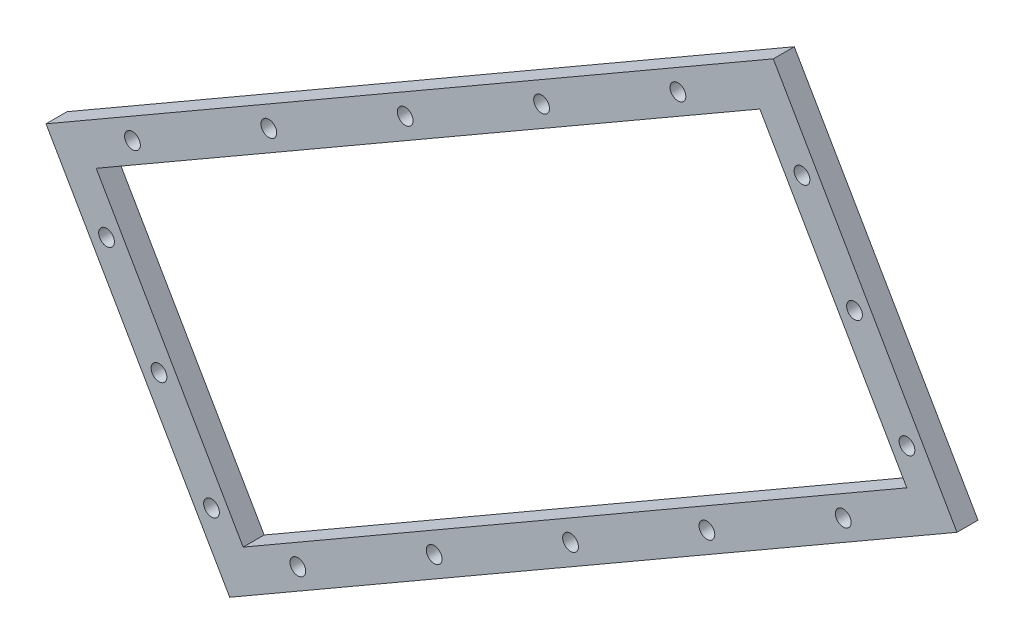
ISO-10303-21;
HEADER;
FILE_DESCRIPTION(('STEP AP214'),'2;1');
FILE_NAME('part.step','',(''),(''),'','','');
FILE_SCHEMA(('AUTOMOTIVE_DESIGN { 1 0 10303 214 1 1 1 1 }'));
ENDSEC;
DATA;
#1=APPLICATION_CONTEXT('core data for automotive mechanical design processes');
#2=APPLICATION_PROTOCOL_DEFINITION('international standard','automotive_design',2000,#1);
#3=PRODUCT_CONTEXT('',#1,'mechanical');
#4=PRODUCT('Part','Part','',(#3));
#5=PRODUCT_RELATED_PRODUCT_CATEGORY('part','',(#4));
#6=PRODUCT_DEFINITION_FORMATION('','',#4);
#7=PRODUCT_DEFINITION_CONTEXT('part definition',#1,'design');
#8=PRODUCT_DEFINITION('design','',#6,#7);
#9=PRODUCT_DEFINITION_SHAPE('','',#8);
#10=(LENGTH_UNIT() NAMED_UNIT(*) SI_UNIT(.MILLI.,.METRE.));
#11=(NAMED_UNIT(*) PLANE_ANGLE_UNIT() SI_UNIT($,.RADIAN.));
#12=(NAMED_UNIT(*) SI_UNIT($,.STERADIAN.) SOLID_ANGLE_UNIT());
#13=UNCERTAINTY_MEASURE_WITH_UNIT(LENGTH_MEASURE(1.E-05),#10,'distance_accuracy_value','');
#14=(GEOMETRIC_REPRESENTATION_CONTEXT(3) GLOBAL_UNCERTAINTY_ASSIGNED_CONTEXT((#13)) GLOBAL_UNIT_ASSIGNED_CONTEXT((#10,
#11,#12)) REPRESENTATION_CONTEXT('',''));
#15=CARTESIAN_POINT('',(0.,0.,0.));
#16=DIRECTION('',(0.,0.,1.));
#17=DIRECTION('',(1.,0.,0.));
#18=AXIS2_PLACEMENT_3D('',#15,#16,#17);
#19=CARTESIAN_POINT('',(-80.3616729028382,-5.98231463967729,236.380771430245));
#20=DIRECTION('',(0.866025403784439,0.5,0.));
#21=DIRECTION('',(-0.5,0.866025403784439,0.));
#22=AXIS2_PLACEMENT_3D('',#19,#20,#21);
#23=PLANE('',#22);
#24=DIRECTION('',(0.5,-0.866025403784439,0.));
#25=VECTOR('',#24,1.);
#26=CARTESIAN_POINT('',(-80.3616729028382,-5.98231463967729,7.00000000000001));
#27=LINE('',#26,#25);
#28=CARTESIAN_POINT('',(-80.3616729028382,-5.9823146396773,7.00000000000001));
#29=VERTEX_POINT('',#28);
#30=CARTESIAN_POINT('',(-45.3616729028381,-66.604092904588,7.00000000000001));
#31=VERTEX_POINT('',#30);
#32=EDGE_CURVE('E3574',#29,#31,#27,.T.);
#33=ORIENTED_EDGE('',*,*,#32,.F.);
#34=DIRECTION('',(0.,0.,1.));
#35=VECTOR('',#34,1.);
#36=CARTESIAN_POINT('',(-80.3616729028382,-5.9823146396773,-66.));
#37=LINE('',#36,#35);
#38=CARTESIAN_POINT('',(-80.3616729028382,-5.9823146396773,3.));
#39=VERTEX_POINT('',#38);
#40=EDGE_CURVE('E3701',#39,#29,#37,.T.);
#41=ORIENTED_EDGE('',*,*,#40,.F.);
#42=DIRECTION('',(0.5,-0.866025403784439,0.));
#43=VECTOR('',#42,1.);
#44=CARTESIAN_POINT('',(-80.3616729028382,-5.98231463967729,3.));
#45=LINE('',#44,#43);
#46=CARTESIAN_POINT('',(-45.3616729028381,-66.604092904588,3.));
#47=VERTEX_POINT('',#46);
#48=EDGE_CURVE('E3735',#39,#47,#45,.T.);
#49=ORIENTED_EDGE('',*,*,#48,.T.);
#50=DIRECTION('',(0.,0.,1.));
#51=VECTOR('',#50,1.);
#52=CARTESIAN_POINT('',(-45.3616729028381,-66.604092904588,-66.));
#53=LINE('',#52,#51);
#54=EDGE_CURVE('E3692',#47,#31,#53,.T.);
#55=ORIENTED_EDGE('',*,*,#54,.T.);
#56=EDGE_LOOP('',(#33,#41,#49,#55));
#57=FACE_BOUND('',#56,.T.);
#58=ADVANCED_FACE('F3556',(#57),#23,.F.);
#59=CARTESIAN_POINT('',(58.202391702672,74.0176853603227,236.380771430245));
#60=DIRECTION('',(-0.866025403784439,-0.5,0.));
#61=DIRECTION('',(0.5,-0.866025403784439,0.));
#62=AXIS2_PLACEMENT_3D('',#59,#60,#61);
#63=PLANE('',#62);
#64=DIRECTION('',(-0.5,0.866025403784439,0.));
#65=VECTOR('',#64,1.);
#66=CARTESIAN_POINT('',(58.202391702672,74.0176853603227,7.00000000000001));
#67=LINE('',#66,#65);
#68=CARTESIAN_POINT('',(93.202391702672,13.395907095412,7.00000000000001));
#69=VERTEX_POINT('',#68);
#70=CARTESIAN_POINT('',(58.202391702672,74.0176853603227,7.00000000000001));
#71=VERTEX_POINT('',#70);
#72=EDGE_CURVE('E3780',#69,#71,#67,.T.);
#73=ORIENTED_EDGE('',*,*,#72,.F.);
#74=DIRECTION('',(0.,0.,-1.));
#75=VECTOR('',#74,1.);
#76=CARTESIAN_POINT('',(93.202391702672,13.395907095412,236.380771430245));
#77=LINE('',#76,#75);
#78=CARTESIAN_POINT('',(93.202391702672,13.3959070954119,3.));
#79=VERTEX_POINT('',#78);
#80=EDGE_CURVE('E3746',#69,#79,#77,.T.);
#81=ORIENTED_EDGE('',*,*,#80,.T.);
#82=DIRECTION('',(-0.5,0.866025403784439,0.));
#83=VECTOR('',#82,1.);
#84=CARTESIAN_POINT('',(58.202391702672,74.0176853603227,3.));
#85=LINE('',#84,#83);
#86=CARTESIAN_POINT('',(58.202391702672,74.0176853603227,3.));
#87=VERTEX_POINT('',#86);
#88=EDGE_CURVE('E3742',#79,#87,#85,.T.);
#89=ORIENTED_EDGE('',*,*,#88,.T.);
#90=DIRECTION('',(0.,0.,-1.));
#91=VECTOR('',#90,1.);
#92=CARTESIAN_POINT('',(58.202391702672,74.0176853603227,236.380771430245));
#93=LINE('',#92,#91);
#94=EDGE_CURVE('E3741',#71,#87,#93,.T.);
#95=ORIENTED_EDGE('',*,*,#94,.F.);
#96=EDGE_LOOP('',(#73,#81,#89,#95));
#97=FACE_BOUND('',#96,.T.);
#98=ADVANCED_FACE('F3798',(#97),#63,.F.);
#99=CARTESIAN_POINT('',(-80.3616729028382,-5.98231463967729,236.380771430245));
#100=DIRECTION('',(0.5,-0.866025403784438,0.));
#101=DIRECTION('',(0.866025403784439,0.5,0.));
#102=AXIS2_PLACEMENT_3D('',#99,#100,#101);
#103=PLANE('',#102);
#104=DIRECTION('',(-0.866025403784439,-0.5,0.));
#105=VECTOR('',#104,1.);
#106=CARTESIAN_POINT('',(-80.3616729028382,-5.98231463967729,7.00000000000001));
#107=LINE('',#106,#105);
#108=EDGE_CURVE('E3708',#71,#29,#107,.T.);
#109=ORIENTED_EDGE('',*,*,#108,.F.);
#110=ORIENTED_EDGE('',*,*,#94,.T.);
#111=DIRECTION('',(-0.866025403784438,-0.5,0.));
#112=VECTOR('',#111,1.);
#113=CARTESIAN_POINT('',(-80.3616729028382,-5.98231463967729,3.));
#114=LINE('',#113,#112);
#115=EDGE_CURVE('E3738',#87,#39,#114,.T.);
#116=ORIENTED_EDGE('',*,*,#115,.T.);
#117=ORIENTED_EDGE('',*,*,#40,.T.);
#118=EDGE_LOOP('',(#109,#110,#116,#117));
#119=FACE_BOUND('',#118,.T.);
#120=ADVANCED_FACE('F3789',(#119),#103,.F.);
#121=CARTESIAN_POINT('',(-45.3616729028382,-66.6040929045879,236.380771430245));
#122=DIRECTION('',(-0.499999999999999,0.866025403784439,0.));
#123=DIRECTION('',(-0.866025403784439,-0.499999999999999,0.));
#124=AXIS2_PLACEMENT_3D('',#121,#122,#123);
#125=PLANE('',#124);
#126=DIRECTION('',(0.866025403784439,0.499999999999999,0.));
#127=VECTOR('',#126,1.);
#128=CARTESIAN_POINT('',(-45.3616729028382,-66.6040929045879,7.00000000000001));
#129=LINE('',#128,#127);
#130=EDGE_CURVE('E3775',#31,#69,#129,.T.);
#131=ORIENTED_EDGE('',*,*,#130,.F.);
#132=ORIENTED_EDGE('',*,*,#54,.F.);
#133=DIRECTION('',(0.866025403784439,0.499999999999999,0.));
#134=VECTOR('',#133,1.);
#135=CARTESIAN_POINT('',(-45.3616729028382,-66.6040929045879,3.));
#136=LINE('',#135,#134);
#137=EDGE_CURVE('E3731',#47,#79,#136,.T.);
#138=ORIENTED_EDGE('',*,*,#137,.T.);
#139=ORIENTED_EDGE('',*,*,#80,.F.);
#140=EDGE_LOOP('',(#131,#132,#138,#139));
#141=FACE_BOUND('',#140,.T.);
#142=ADVANCED_FACE('F3795',(#141),#125,.F.);
#143=CARTESIAN_POINT('',(-70.7994950763471,-8.54449246616836,236.380771430245));
#144=DIRECTION('',(0.5,-0.866025403784439,0.));
#145=DIRECTION('',(0.866025403784439,0.5,0.));
#146=AXIS2_PLACEMENT_3D('',#143,#144,#145);
#147=PLANE('',#146);
#148=DIRECTION('',(0.,0.,-1.));
#149=VECTOR('',#148,1.);
#150=CARTESIAN_POINT('',(55.640213876181,64.4555075338316,236.380771430245));
#151=LINE('',#150,#149);
#152=CARTESIAN_POINT('',(55.640213876181,64.4555075338316,7.00000000000001));
#153=VERTEX_POINT('',#152);
#154=CARTESIAN_POINT('',(55.640213876181,64.4555075338316,3.));
#155=VERTEX_POINT('',#154);
#156=EDGE_CURVE('E3566',#153,#155,#151,.T.);
#157=ORIENTED_EDGE('',*,*,#156,.F.);
#158=DIRECTION('',(-0.866025403784439,-0.5,0.));
#159=VECTOR('',#158,1.);
#160=CARTESIAN_POINT('',(-70.7994950763471,-8.54449246616836,7.00000000000001));
#161=LINE('',#160,#159);
#162=CARTESIAN_POINT('',(-70.7994950763471,-8.54449246616836,7.00000000000001));
#163=VERTEX_POINT('',#162);
#164=EDGE_CURVE('E3582',#153,#163,#161,.T.);
#165=ORIENTED_EDGE('',*,*,#164,.T.);
#166=DIRECTION('',(0.,0.,-1.));
#167=VECTOR('',#166,1.);
#168=CARTESIAN_POINT('',(-70.7994950763471,-8.54449246616836,236.380771430245));
#169=LINE('',#168,#167);
#170=CARTESIAN_POINT('',(-70.7994950763471,-8.54449246616836,3.));
#171=VERTEX_POINT('',#170);
#172=EDGE_CURVE('E3651',#163,#171,#169,.T.);
#173=ORIENTED_EDGE('',*,*,#172,.T.);
#174=DIRECTION('',(-0.866025403784438,-0.5,0.));
#175=VECTOR('',#174,1.);
#176=CARTESIAN_POINT('',(-70.7994950763471,-8.54449246616836,3.));
#177=LINE('',#176,#175);
#178=EDGE_CURVE('E3687',#155,#171,#177,.T.);
#179=ORIENTED_EDGE('',*,*,#178,.F.);
#180=EDGE_LOOP('',(#157,#165,#173,#179));
#181=FACE_BOUND('',#180,.T.);
#182=ADVANCED_FACE('F3558',(#181),#147,.T.);
#183=CARTESIAN_POINT('',(-70.7994950763471,-8.54449246616836,236.380771430245));
#184=DIRECTION('',(0.866025403784439,0.5,0.));
#185=DIRECTION('',(-0.5,0.866025403784439,0.));
#186=AXIS2_PLACEMENT_3D('',#183,#184,#185);
#187=PLANE('',#186);
#188=ORIENTED_EDGE('',*,*,#172,.F.);
#189=DIRECTION('',(0.5,-0.866025403784439,0.));
#190=VECTOR('',#189,1.);
#191=CARTESIAN_POINT('',(-70.7994950763471,-8.54449246616836,7.00000000000001));
#192=LINE('',#191,#190);
#193=CARTESIAN_POINT('',(-42.7994950763471,-57.0419150780968,7.00000000000001));
#194=VERTEX_POINT('',#193);
#195=EDGE_CURVE('E3640',#163,#194,#192,.T.);
#196=ORIENTED_EDGE('',*,*,#195,.T.);
#197=DIRECTION('',(0.,0.,-1.));
#198=VECTOR('',#197,1.);
#199=CARTESIAN_POINT('',(-42.7994950763471,-57.0419150780968,236.380771430245));
#200=LINE('',#199,#198);
#201=CARTESIAN_POINT('',(-42.7994950763471,-57.0419150780968,3.));
#202=VERTEX_POINT('',#201);
#203=EDGE_CURVE('E3638',#194,#202,#200,.T.);
#204=ORIENTED_EDGE('',*,*,#203,.T.);
#205=DIRECTION('',(0.5,-0.866025403784439,0.));
#206=VECTOR('',#205,1.);
#207=CARTESIAN_POINT('',(-70.7994950763471,-8.54449246616836,3.));
#208=LINE('',#207,#206);
#209=EDGE_CURVE('E3752',#171,#202,#208,.T.);
#210=ORIENTED_EDGE('',*,*,#209,.F.);
#211=EDGE_LOOP('',(#188,#196,#204,#210));
#212=FACE_BOUND('',#211,.T.);
#213=ADVANCED_FACE('F3771',(#212),#187,.T.);
#214=CARTESIAN_POINT('',(-42.7994950763471,-57.0419150780968,236.380771430245));
#215=DIRECTION('',(-0.5,0.866025403784438,0.));
#216=DIRECTION('',(-0.866025403784439,-0.5,0.));
#217=AXIS2_PLACEMENT_3D('',#214,#215,#216);
#218=PLANE('',#217);
#219=ORIENTED_EDGE('',*,*,#203,.F.);
#220=DIRECTION('',(0.866025403784439,0.5,0.));
#221=VECTOR('',#220,1.);
#222=CARTESIAN_POINT('',(-42.7994950763471,-57.0419150780968,7.00000000000001));
#223=LINE('',#222,#221);
#224=CARTESIAN_POINT('',(83.6402138761809,15.9580849219032,7.00000000000001));
#225=VERTEX_POINT('',#224);
#226=EDGE_CURVE('E3624',#194,#225,#223,.T.);
#227=ORIENTED_EDGE('',*,*,#226,.T.);
#228=DIRECTION('',(0.,0.,-1.));
#229=VECTOR('',#228,1.);
#230=CARTESIAN_POINT('',(83.6402138761809,15.9580849219032,236.380771430245));
#231=LINE('',#230,#229);
#232=CARTESIAN_POINT('',(83.6402138761809,15.9580849219032,3.));
#233=VERTEX_POINT('',#232);
#234=EDGE_CURVE('E3636',#225,#233,#231,.T.);
#235=ORIENTED_EDGE('',*,*,#234,.T.);
#236=DIRECTION('',(0.866025403784438,0.5,0.));
#237=VECTOR('',#236,1.);
#238=CARTESIAN_POINT('',(-42.7994950763471,-57.0419150780968,3.));
#239=LINE('',#238,#237);
#240=EDGE_CURVE('E3749',#202,#233,#239,.T.);
#241=ORIENTED_EDGE('',*,*,#240,.F.);
#242=EDGE_LOOP('',(#219,#227,#235,#241));
#243=FACE_BOUND('',#242,.T.);
#244=ADVANCED_FACE('F3634',(#243),#218,.T.);
#245=CARTESIAN_POINT('',(55.640213876181,64.4555075338316,236.380771430245));
#246=DIRECTION('',(-0.866025403784439,-0.5,0.));
#247=DIRECTION('',(0.5,-0.866025403784439,0.));
#248=AXIS2_PLACEMENT_3D('',#245,#246,#247);
#249=PLANE('',#248);
#250=ORIENTED_EDGE('',*,*,#234,.F.);
#251=DIRECTION('',(-0.5,0.866025403784439,0.));
#252=VECTOR('',#251,1.);
#253=CARTESIAN_POINT('',(55.640213876181,64.4555075338316,7.00000000000001));
#254=LINE('',#253,#252);
#255=EDGE_CURVE('E3621',#225,#153,#254,.T.);
#256=ORIENTED_EDGE('',*,*,#255,.T.);
#257=ORIENTED_EDGE('',*,*,#156,.T.);
#258=DIRECTION('',(-0.5,0.866025403784439,0.));
#259=VECTOR('',#258,1.);
#260=CARTESIAN_POINT('',(55.640213876181,64.4555075338316,3.));
#261=LINE('',#260,#259);
#262=EDGE_CURVE('E3645',#233,#155,#261,.T.);
#263=ORIENTED_EDGE('',*,*,#262,.F.);
#264=EDGE_LOOP('',(#250,#256,#257,#263));
#265=FACE_BOUND('',#264,.T.);
#266=ADVANCED_FACE('F3643',(#265),#249,.T.);
#267=CARTESIAN_POINT('',(-32.3892410384757,-55.0730039913892,-252.));
#268=DIRECTION('',(0.,0.,1.));
#269=DIRECTION('',(1.,0.,0.));
#270=AXIS2_PLACEMENT_3D('',#267,#268,#269);
#271=CYLINDRICAL_SURFACE('',#270,1.50000000001222);
#272=CARTESIAN_POINT('',(-32.3892410384757,-55.0730039913892,3.));
#273=DIRECTION('',(0.,0.,1.));
#274=DIRECTION('',(1.,0.,0.));
#275=AXIS2_PLACEMENT_3D('',#272,#273,#274);
#276=CIRCLE('',#275,1.50000000001222);
#277=CARTESIAN_POINT('',(-30.8892410384635,-55.0730039913892,3.));
#278=VERTEX_POINT('',#277);
#279=EDGE_CURVE('E3655',#278,#278,#276,.T.);
#280=ORIENTED_EDGE('',*,*,#279,.F.);
#281=EDGE_LOOP('',(#280));
#282=FACE_BOUND('',#281,.T.);
#283=CARTESIAN_POINT('',(-32.3892410384757,-55.0730039913892,7.00000000000001));
#284=DIRECTION('',(0.,0.,1.));
#285=DIRECTION('',(1.,0.,0.));
#286=AXIS2_PLACEMENT_3D('',#283,#284,#285);
#287=CIRCLE('',#286,1.50000000001222);
#288=CARTESIAN_POINT('',(-30.8892410384635,-55.0730039913892,7.00000000000001));
#289=VERTEX_POINT('',#288);
#290=EDGE_CURVE('E3630',#289,#289,#287,.F.);
#291=ORIENTED_EDGE('',*,*,#290,.F.);
#292=EDGE_LOOP('',(#291));
#293=FACE_BOUND('',#292,.T.);
#294=ADVANCED_FACE('F3810',(#282,#293),#271,.F.);
#295=CARTESIAN_POINT('',(-6.40847892494256,-40.0730039913892,-252.));
#296=DIRECTION('',(0.,0.,1.));
#297=DIRECTION('',(1.,0.,0.));
#298=AXIS2_PLACEMENT_3D('',#295,#296,#297);
#299=CYLINDRICAL_SURFACE('',#298,1.50000000001676);
#300=CARTESIAN_POINT('',(-6.40847892494256,-40.0730039913892,3.));
#301=DIRECTION('',(0.,0.,1.));
#302=DIRECTION('',(1.,0.,0.));
#303=AXIS2_PLACEMENT_3D('',#300,#301,#302);
#304=CIRCLE('',#303,1.50000000001676);
#305=CARTESIAN_POINT('',(-4.90847892492579,-40.0730039913892,3.));
#306=VERTEX_POINT('',#305);
#307=EDGE_CURVE('E3659',#306,#306,#304,.T.);
#308=ORIENTED_EDGE('',*,*,#307,.F.);
#309=EDGE_LOOP('',(#308));
#310=FACE_BOUND('',#309,.T.);
#311=CARTESIAN_POINT('',(-6.40847892494256,-40.0730039913892,7.00000000000001));
#312=DIRECTION('',(0.,0.,1.));
#313=DIRECTION('',(1.,0.,0.));
#314=AXIS2_PLACEMENT_3D('',#311,#312,#313);
#315=CIRCLE('',#314,1.50000000001676);
#316=CARTESIAN_POINT('',(-4.90847892492579,-40.0730039913892,7.00000000000001));
#317=VERTEX_POINT('',#316);
#318=EDGE_CURVE('E3898',#317,#317,#315,.F.);
#319=ORIENTED_EDGE('',*,*,#318,.F.);
#320=EDGE_LOOP('',(#319));
#321=FACE_BOUND('',#320,.T.);
#322=ADVANCED_FACE('F3867',(#310,#321),#299,.F.);
#323=CARTESIAN_POINT('',(19.5722831885906,-25.0730039913892,-252.));
#324=DIRECTION('',(0.,0.,1.));
#325=DIRECTION('',(1.,0.,0.));
#326=AXIS2_PLACEMENT_3D('',#323,#324,#325);
#327=CYLINDRICAL_SURFACE('',#326,1.50000000002132);
#328=CARTESIAN_POINT('',(19.5722831885906,-25.0730039913892,3.));
#329=DIRECTION('',(0.,0.,1.));
#330=DIRECTION('',(1.,0.,0.));
#331=AXIS2_PLACEMENT_3D('',#328,#329,#330);
#332=CIRCLE('',#331,1.50000000002132);
#333=CARTESIAN_POINT('',(21.0722831886119,-25.0730039913892,3.));
#334=VERTEX_POINT('',#333);
#335=EDGE_CURVE('E3664',#334,#334,#332,.T.);
#336=ORIENTED_EDGE('',*,*,#335,.F.);
#337=EDGE_LOOP('',(#336));
#338=FACE_BOUND('',#337,.T.);
#339=CARTESIAN_POINT('',(19.5722831885906,-25.0730039913892,7.00000000000001));
#340=DIRECTION('',(0.,0.,1.));
#341=DIRECTION('',(1.,0.,0.));
#342=AXIS2_PLACEMENT_3D('',#339,#340,#341);
#343=CIRCLE('',#342,1.50000000002132);
#344=CARTESIAN_POINT('',(21.0722831886119,-25.0730039913892,7.00000000000001));
#345=VERTEX_POINT('',#344);
#346=EDGE_CURVE('E3902',#345,#345,#343,.F.);
#347=ORIENTED_EDGE('',*,*,#346,.F.);
#348=EDGE_LOOP('',(#347));
#349=FACE_BOUND('',#348,.T.);
#350=ADVANCED_FACE('F3871',(#338,#349),#327,.F.);
#351=CARTESIAN_POINT('',(45.5530453021238,-10.0730039913892,-252.));
#352=DIRECTION('',(0.,0.,1.));
#353=DIRECTION('',(1.,0.,0.));
#354=AXIS2_PLACEMENT_3D('',#351,#352,#353);
#355=CYLINDRICAL_SURFACE('',#354,1.50000000002586);
#356=CARTESIAN_POINT('',(45.5530453021238,-10.0730039913892,3.));
#357=DIRECTION('',(0.,0.,1.));
#358=DIRECTION('',(1.,0.,0.));
#359=AXIS2_PLACEMENT_3D('',#356,#357,#358);
#360=CIRCLE('',#359,1.50000000002586);
#361=CARTESIAN_POINT('',(47.0530453021496,-10.0730039913892,3.));
#362=VERTEX_POINT('',#361);
#363=EDGE_CURVE('E3668',#362,#362,#360,.T.);
#364=ORIENTED_EDGE('',*,*,#363,.F.);
#365=EDGE_LOOP('',(#364));
#366=FACE_BOUND('',#365,.T.);
#367=CARTESIAN_POINT('',(45.5530453021238,-10.0730039913892,7.00000000000001));
#368=DIRECTION('',(0.,0.,1.));
#369=DIRECTION('',(1.,0.,0.));
#370=AXIS2_PLACEMENT_3D('',#367,#368,#369);
#371=CIRCLE('',#370,1.50000000002586);
#372=CARTESIAN_POINT('',(47.0530453021496,-10.0730039913892,7.00000000000001));
#373=VERTEX_POINT('',#372);
#374=EDGE_CURVE('E3906',#373,#373,#371,.F.);
#375=ORIENTED_EDGE('',*,*,#374,.F.);
#376=EDGE_LOOP('',(#375));
#377=FACE_BOUND('',#376,.T.);
#378=ADVANCED_FACE('F3854',(#366,#377),#355,.F.);
#379=CARTESIAN_POINT('',(-58.8305839895926,-36.2752545797015,-252.));
#380=DIRECTION('',(0.,0.,1.));
#381=DIRECTION('',(1.,0.,0.));
#382=AXIS2_PLACEMENT_3D('',#379,#380,#381);
#383=CYLINDRICAL_SURFACE('',#382,1.5);
#384=CARTESIAN_POINT('',(-58.8305839895926,-36.2752545797015,3.));
#385=DIRECTION('',(0.,0.,1.));
#386=DIRECTION('',(1.,0.,0.));
#387=AXIS2_PLACEMENT_3D('',#384,#385,#386);
#388=CIRCLE('',#387,1.5);
#389=CARTESIAN_POINT('',(-57.3305839895926,-36.2752545797015,3.));
#390=VERTEX_POINT('',#389);
#391=EDGE_CURVE('E12',#390,#390,#388,.T.);
#392=ORIENTED_EDGE('',*,*,#391,.F.);
#393=EDGE_LOOP('',(#392));
#394=FACE_BOUND('',#393,.T.);
#395=CARTESIAN_POINT('',(-58.8305839895926,-36.2752545797015,7.00000000000001));
#396=DIRECTION('',(0.,0.,1.));
#397=DIRECTION('',(1.,0.,0.));
#398=AXIS2_PLACEMENT_3D('',#395,#396,#397);
#399=CIRCLE('',#398,1.5);
#400=CARTESIAN_POINT('',(-57.3305839895926,-36.2752545797015,7.00000000000001));
#401=VERTEX_POINT('',#400);
#402=EDGE_CURVE('E3910',#401,#401,#399,.F.);
#403=ORIENTED_EDGE('',*,*,#402,.F.);
#404=EDGE_LOOP('',(#403));
#405=FACE_BOUND('',#404,.T.);
#406=ADVANCED_FACE('F3832',(#394,#405),#383,.F.);
#407=CARTESIAN_POINT('',(-63.8892410385027,-0.513403552922828,-252.));
#408=DIRECTION('',(0.,0.,1.));
#409=DIRECTION('',(1.,0.,0.));
#410=AXIS2_PLACEMENT_3D('',#407,#408,#409);
#411=CYLINDRICAL_SURFACE('',#410,1.5);
#412=CARTESIAN_POINT('',(-63.8892410385027,-0.513403552922828,3.));
#413=DIRECTION('',(0.,0.,1.));
#414=DIRECTION('',(1.,0.,0.));
#415=AXIS2_PLACEMENT_3D('',#412,#413,#414);
#416=CIRCLE('',#415,1.5);
#417=CARTESIAN_POINT('',(-62.3892410385027,-0.513403552922828,3.));
#418=VERTEX_POINT('',#417);
#419=EDGE_CURVE('E3671',#418,#418,#416,.T.);
#420=ORIENTED_EDGE('',*,*,#419,.F.);
#421=EDGE_LOOP('',(#420));
#422=FACE_BOUND('',#421,.T.);
#423=CARTESIAN_POINT('',(-63.8892410385027,-0.513403552922828,7.00000000000001));
#424=DIRECTION('',(0.,0.,1.));
#425=DIRECTION('',(1.,0.,0.));
#426=AXIS2_PLACEMENT_3D('',#423,#424,#425);
#427=CIRCLE('',#426,1.5);
#428=CARTESIAN_POINT('',(-62.3892410385027,-0.513403552922828,7.00000000000001));
#429=VERTEX_POINT('',#428);
#430=EDGE_CURVE('E3914',#429,#429,#427,.F.);
#431=ORIENTED_EDGE('',*,*,#430,.F.);
#432=EDGE_LOOP('',(#431));
#433=FACE_BOUND('',#432,.T.);
#434=ADVANCED_FACE('F3828',(#422,#433),#411,.F.);
#435=CARTESIAN_POINT('',(-37.9084789249695,14.4865964470772,-252.));
#436=DIRECTION('',(0.,0.,1.));
#437=DIRECTION('',(1.,0.,0.));
#438=AXIS2_PLACEMENT_3D('',#435,#436,#437);
#439=CYLINDRICAL_SURFACE('',#438,1.5);
#440=CARTESIAN_POINT('',(-37.9084789249695,14.4865964470772,3.));
#441=DIRECTION('',(0.,0.,1.));
#442=DIRECTION('',(1.,0.,0.));
#443=AXIS2_PLACEMENT_3D('',#440,#441,#442);
#444=CIRCLE('',#443,1.5);
#445=CARTESIAN_POINT('',(-36.4084789249695,14.4865964470772,3.));
#446=VERTEX_POINT('',#445);
#447=EDGE_CURVE('E3676',#446,#446,#444,.T.);
#448=ORIENTED_EDGE('',*,*,#447,.F.);
#449=EDGE_LOOP('',(#448));
#450=FACE_BOUND('',#449,.T.);
#451=CARTESIAN_POINT('',(-37.9084789249695,14.4865964470772,7.00000000000001));
#452=DIRECTION('',(0.,0.,1.));
#453=DIRECTION('',(1.,0.,0.));
#454=AXIS2_PLACEMENT_3D('',#451,#452,#453);
#455=CIRCLE('',#454,1.5);
#456=CARTESIAN_POINT('',(-36.4084789249695,14.4865964470772,7.00000000000001));
#457=VERTEX_POINT('',#456);
#458=EDGE_CURVE('E3918',#457,#457,#455,.F.);
#459=ORIENTED_EDGE('',*,*,#458,.F.);
#460=EDGE_LOOP('',(#459));
#461=FACE_BOUND('',#460,.T.);
#462=ADVANCED_FACE('F3831',(#450,#461),#439,.F.);
#463=CARTESIAN_POINT('',(-11.9277168114364,29.4865964470772,-252.));
#464=DIRECTION('',(0.,0.,1.));
#465=DIRECTION('',(1.,0.,0.));
#466=AXIS2_PLACEMENT_3D('',#463,#464,#465);
#467=CYLINDRICAL_SURFACE('',#466,1.5);
#468=CARTESIAN_POINT('',(-11.9277168114364,29.4865964470772,3.));
#469=DIRECTION('',(0.,0.,1.));
#470=DIRECTION('',(1.,0.,0.));
#471=AXIS2_PLACEMENT_3D('',#468,#469,#470);
#472=CIRCLE('',#471,1.5);
#473=CARTESIAN_POINT('',(-10.4277168114364,29.4865964470772,3.));
#474=VERTEX_POINT('',#473);
#475=EDGE_CURVE('E3680',#474,#474,#472,.T.);
#476=ORIENTED_EDGE('',*,*,#475,.F.);
#477=EDGE_LOOP('',(#476));
#478=FACE_BOUND('',#477,.T.);
#479=CARTESIAN_POINT('',(-11.9277168114364,29.4865964470772,7.00000000000001));
#480=DIRECTION('',(0.,0.,1.));
#481=DIRECTION('',(1.,0.,0.));
#482=AXIS2_PLACEMENT_3D('',#479,#480,#481);
#483=CIRCLE('',#482,1.5);
#484=CARTESIAN_POINT('',(-10.4277168114364,29.4865964470772,7.00000000000001));
#485=VERTEX_POINT('',#484);
#486=EDGE_CURVE('E3922',#485,#485,#483,.F.);
#487=ORIENTED_EDGE('',*,*,#486,.F.);
#488=EDGE_LOOP('',(#487));
#489=FACE_BOUND('',#488,.T.);
#490=ADVANCED_FACE('F3838',(#478,#489),#467,.F.);
#491=CARTESIAN_POINT('',(14.0530453020968,44.4865964470772,-252.));
#492=DIRECTION('',(0.,0.,1.));
#493=DIRECTION('',(1.,0.,0.));
#494=AXIS2_PLACEMENT_3D('',#491,#492,#493);
#495=CYLINDRICAL_SURFACE('',#494,1.5);
#496=CARTESIAN_POINT('',(14.0530453020968,44.4865964470772,3.));
#497=DIRECTION('',(0.,0.,1.));
#498=DIRECTION('',(1.,0.,0.));
#499=AXIS2_PLACEMENT_3D('',#496,#497,#498);
#500=CIRCLE('',#499,1.5);
#501=CARTESIAN_POINT('',(15.5530453020968,44.4865964470772,3.));
#502=VERTEX_POINT('',#501);
#503=EDGE_CURVE('E3684',#502,#502,#500,.T.);
#504=ORIENTED_EDGE('',*,*,#503,.F.);
#505=EDGE_LOOP('',(#504));
#506=FACE_BOUND('',#505,.T.);
#507=CARTESIAN_POINT('',(14.0530453020968,44.4865964470772,7.00000000000001));
#508=DIRECTION('',(0.,0.,1.));
#509=DIRECTION('',(1.,0.,0.));
#510=AXIS2_PLACEMENT_3D('',#507,#508,#509);
#511=CIRCLE('',#510,1.5);
#512=CARTESIAN_POINT('',(15.5530453020968,44.4865964470772,7.00000000000001));
#513=VERTEX_POINT('',#512);
#514=EDGE_CURVE('E3926',#513,#513,#511,.F.);
#515=ORIENTED_EDGE('',*,*,#514,.F.);
#516=EDGE_LOOP('',(#515));
#517=FACE_BOUND('',#516,.T.);
#518=ADVANCED_FACE('F3834',(#506,#517),#495,.F.);
#519=CARTESIAN_POINT('',(71.5338074156569,4.92699600861078,-252.));
#520=DIRECTION('',(0.,0.,1.));
#521=DIRECTION('',(1.,0.,0.));
#522=AXIS2_PLACEMENT_3D('',#519,#520,#521);
#523=CYLINDRICAL_SURFACE('',#522,1.5000000000304);
#524=CARTESIAN_POINT('',(71.5338074156569,4.92699600861078,3.));
#525=DIRECTION('',(0.,0.,1.));
#526=DIRECTION('',(1.,0.,0.));
#527=AXIS2_PLACEMENT_3D('',#524,#525,#526);
#528=CIRCLE('',#527,1.5000000000304);
#529=CARTESIAN_POINT('',(73.0338074156873,4.92699600861078,3.));
#530=VERTEX_POINT('',#529);
#531=EDGE_CURVE('E3660',#530,#530,#528,.F.);
#532=ORIENTED_EDGE('',*,*,#531,.T.);
#533=EDGE_LOOP('',(#532));
#534=FACE_BOUND('',#533,.T.);
#535=CARTESIAN_POINT('',(71.5338074156569,4.92699600861078,7.00000000000001));
#536=DIRECTION('',(0.,0.,1.));
#537=DIRECTION('',(1.,0.,0.));
#538=AXIS2_PLACEMENT_3D('',#535,#536,#537);
#539=CIRCLE('',#538,1.5000000000304);
#540=CARTESIAN_POINT('',(73.0338074156873,4.92699600861078,7.00000000000001));
#541=VERTEX_POINT('',#540);
#542=EDGE_CURVE('E3930',#541,#541,#539,.F.);
#543=ORIENTED_EDGE('',*,*,#542,.F.);
#544=EDGE_LOOP('',(#543));
#545=FACE_BOUND('',#544,.T.);
#546=ADVANCED_FACE('F3837',(#534,#545),#523,.F.);
#547=CARTESIAN_POINT('',(63.6713027894264,57.5452534959872,-252.));
#548=DIRECTION('',(0.,0.,1.));
#549=DIRECTION('',(1.,0.,0.));
#550=AXIS2_PLACEMENT_3D('',#547,#548,#549);
#551=CYLINDRICAL_SURFACE('',#550,1.49999999999999);
#552=CARTESIAN_POINT('',(63.6713027894264,57.5452534959872,3.));
#553=DIRECTION('',(0.,0.,1.));
#554=DIRECTION('',(1.,0.,0.));
#555=AXIS2_PLACEMENT_3D('',#552,#553,#554);
#556=CIRCLE('',#555,1.49999999999999);
#557=CARTESIAN_POINT('',(65.1713027894264,57.5452534959872,3.));
#558=VERTEX_POINT('',#557);
#559=EDGE_CURVE('E3724',#558,#558,#556,.F.);
#560=ORIENTED_EDGE('',*,*,#559,.T.);
#561=EDGE_LOOP('',(#560));
#562=FACE_BOUND('',#561,.T.);
#563=CARTESIAN_POINT('',(63.6713027894264,57.5452534959872,7.00000000000001));
#564=DIRECTION('',(0.,0.,1.));
#565=DIRECTION('',(1.,0.,0.));
#566=AXIS2_PLACEMENT_3D('',#563,#564,#565);
#567=CIRCLE('',#566,1.49999999999999);
#568=CARTESIAN_POINT('',(65.1713027894264,57.5452534959872,7.00000000000001));
#569=VERTEX_POINT('',#568);
#570=EDGE_CURVE('E3934',#569,#569,#567,.F.);
#571=ORIENTED_EDGE('',*,*,#570,.F.);
#572=EDGE_LOOP('',(#571));
#573=FACE_BOUND('',#572,.T.);
#574=ADVANCED_FACE('F3881',(#562,#573),#551,.F.);
#575=CARTESIAN_POINT('',(73.6713027894264,40.2247454202985,-252.));
#576=DIRECTION('',(0.,0.,1.));
#577=DIRECTION('',(1.,0.,0.));
#578=AXIS2_PLACEMENT_3D('',#575,#576,#577);
#579=CYLINDRICAL_SURFACE('',#578,1.50000000000001);
#580=CARTESIAN_POINT('',(73.6713027894264,40.2247454202985,3.));
#581=DIRECTION('',(0.,0.,1.));
#582=DIRECTION('',(1.,0.,0.));
#583=AXIS2_PLACEMENT_3D('',#580,#581,#582);
#584=CIRCLE('',#583,1.50000000000001);
#585=CARTESIAN_POINT('',(75.1713027894264,40.2247454202985,3.));
#586=VERTEX_POINT('',#585);
#587=EDGE_CURVE('E3720',#586,#586,#584,.F.);
#588=ORIENTED_EDGE('',*,*,#587,.T.);
#589=EDGE_LOOP('',(#588));
#590=FACE_BOUND('',#589,.T.);
#591=CARTESIAN_POINT('',(73.6713027894264,40.2247454202985,7.00000000000001));
#592=DIRECTION('',(0.,0.,1.));
#593=DIRECTION('',(1.,0.,0.));
#594=AXIS2_PLACEMENT_3D('',#591,#592,#593);
#595=CIRCLE('',#594,1.50000000000001);
#596=CARTESIAN_POINT('',(75.1713027894264,40.2247454202985,7.00000000000001));
#597=VERTEX_POINT('',#596);
#598=EDGE_CURVE('E3938',#597,#597,#595,.F.);
#599=ORIENTED_EDGE('',*,*,#598,.F.);
#600=EDGE_LOOP('',(#599));
#601=FACE_BOUND('',#600,.T.);
#602=ADVANCED_FACE('F3850',(#590,#601),#579,.F.);
#603=CARTESIAN_POINT('',(-68.8305839895926,-18.9547465040127,-252.));
#604=DIRECTION('',(0.,0.,1.));
#605=DIRECTION('',(1.,0.,0.));
#606=AXIS2_PLACEMENT_3D('',#603,#604,#605);
#607=CYLINDRICAL_SURFACE('',#606,1.5);
#608=CARTESIAN_POINT('',(-68.8305839895926,-18.9547465040127,3.));
#609=DIRECTION('',(0.,0.,1.));
#610=DIRECTION('',(1.,0.,0.));
#611=AXIS2_PLACEMENT_3D('',#608,#609,#610);
#612=CIRCLE('',#611,1.5);
#613=CARTESIAN_POINT('',(-67.3305839895926,-18.9547465040127,3.));
#614=VERTEX_POINT('',#613);
#615=EDGE_CURVE('E3716',#614,#614,#612,.F.);
#616=ORIENTED_EDGE('',*,*,#615,.T.);
#617=EDGE_LOOP('',(#616));
#618=FACE_BOUND('',#617,.T.);
#619=CARTESIAN_POINT('',(-68.8305839895926,-18.9547465040127,7.00000000000001));
#620=DIRECTION('',(0.,0.,1.));
#621=DIRECTION('',(1.,0.,0.));
#622=AXIS2_PLACEMENT_3D('',#619,#620,#621);
#623=CIRCLE('',#622,1.5);
#624=CARTESIAN_POINT('',(-67.3305839895926,-18.9547465040127,7.00000000000001));
#625=VERTEX_POINT('',#624);
#626=EDGE_CURVE('E3942',#625,#625,#623,.F.);
#627=ORIENTED_EDGE('',*,*,#626,.F.);
#628=EDGE_LOOP('',(#627));
#629=FACE_BOUND('',#628,.T.);
#630=ADVANCED_FACE('F3846',(#618,#629),#607,.F.);
#631=CARTESIAN_POINT('',(83.6713027894264,22.9042373446097,-252.));
#632=DIRECTION('',(0.,0.,1.));
#633=DIRECTION('',(1.,0.,0.));
#634=AXIS2_PLACEMENT_3D('',#631,#632,#633);
#635=CYLINDRICAL_SURFACE('',#634,1.50000000000001);
#636=CARTESIAN_POINT('',(83.6713027894264,22.9042373446097,3.));
#637=DIRECTION('',(0.,0.,1.));
#638=DIRECTION('',(1.,0.,0.));
#639=AXIS2_PLACEMENT_3D('',#636,#637,#638);
#640=CIRCLE('',#639,1.50000000000001);
#641=CARTESIAN_POINT('',(85.1713027894264,22.9042373446097,3.));
#642=VERTEX_POINT('',#641);
#643=EDGE_CURVE('E3698',#642,#642,#640,.F.);
#644=ORIENTED_EDGE('',*,*,#643,.T.);
#645=EDGE_LOOP('',(#644));
#646=FACE_BOUND('',#645,.T.);
#647=CARTESIAN_POINT('',(83.6713027894264,22.9042373446097,7.00000000000001));
#648=DIRECTION('',(0.,0.,1.));
#649=DIRECTION('',(1.,0.,0.));
#650=AXIS2_PLACEMENT_3D('',#647,#648,#649);
#651=CIRCLE('',#650,1.50000000000001);
#652=CARTESIAN_POINT('',(85.1713027894264,22.9042373446097,7.00000000000001));
#653=VERTEX_POINT('',#652);
#654=EDGE_CURVE('E3946',#653,#653,#651,.F.);
#655=ORIENTED_EDGE('',*,*,#654,.F.);
#656=EDGE_LOOP('',(#655));
#657=FACE_BOUND('',#656,.T.);
#658=ADVANCED_FACE('F3849',(#646,#657),#635,.F.);
#659=CARTESIAN_POINT('',(-48.8305839895926,-53.5957626553903,-252.));
#660=DIRECTION('',(0.,0.,1.));
#661=DIRECTION('',(1.,0.,0.));
#662=AXIS2_PLACEMENT_3D('',#659,#660,#661);
#663=CYLINDRICAL_SURFACE('',#662,1.5);
#664=CARTESIAN_POINT('',(-48.8305839895926,-53.5957626553903,3.));
#665=DIRECTION('',(0.,0.,1.));
#666=DIRECTION('',(1.,0.,0.));
#667=AXIS2_PLACEMENT_3D('',#664,#665,#666);
#668=CIRCLE('',#667,1.5);
#669=CARTESIAN_POINT('',(-47.3305839895926,-53.5957626553903,3.));
#670=VERTEX_POINT('',#669);
#671=EDGE_CURVE('E3691',#670,#670,#668,.F.);
#672=ORIENTED_EDGE('',*,*,#671,.T.);
#673=EDGE_LOOP('',(#672));
#674=FACE_BOUND('',#673,.T.);
#675=CARTESIAN_POINT('',(-48.8305839895926,-53.5957626553903,7.00000000000001));
#676=DIRECTION('',(0.,0.,1.));
#677=DIRECTION('',(1.,0.,0.));
#678=AXIS2_PLACEMENT_3D('',#675,#676,#677);
#679=CIRCLE('',#678,1.5);
#680=CARTESIAN_POINT('',(-47.3305839895926,-53.5957626553903,7.00000000000001));
#681=VERTEX_POINT('',#680);
#682=EDGE_CURVE('E3950',#681,#681,#679,.F.);
#683=ORIENTED_EDGE('',*,*,#682,.F.);
#684=EDGE_LOOP('',(#683));
#685=FACE_BOUND('',#684,.T.);
#686=ADVANCED_FACE('F3858',(#674,#685),#663,.F.);
#687=CARTESIAN_POINT('',(40.0338074156299,59.4865964470772,-252.));
#688=DIRECTION('',(0.,0.,1.));
#689=DIRECTION('',(1.,0.,0.));
#690=AXIS2_PLACEMENT_3D('',#687,#688,#689);
#691=CYLINDRICAL_SURFACE('',#690,1.5);
#692=CARTESIAN_POINT('',(40.0338074156299,59.4865964470772,3.));
#693=DIRECTION('',(0.,0.,1.));
#694=DIRECTION('',(1.,0.,0.));
#695=AXIS2_PLACEMENT_3D('',#692,#693,#694);
#696=CIRCLE('',#695,1.5);
#697=CARTESIAN_POINT('',(41.5338074156299,59.4865964470772,3.));
#698=VERTEX_POINT('',#697);
#699=EDGE_CURVE('E3688',#698,#698,#696,.F.);
#700=ORIENTED_EDGE('',*,*,#699,.T.);
#701=EDGE_LOOP('',(#700));
#702=FACE_BOUND('',#701,.T.);
#703=CARTESIAN_POINT('',(40.0338074156299,59.4865964470772,7.00000000000001));
#704=DIRECTION('',(0.,0.,1.));
#705=DIRECTION('',(1.,0.,0.));
#706=AXIS2_PLACEMENT_3D('',#703,#704,#705);
#707=CIRCLE('',#706,1.5);
#708=CARTESIAN_POINT('',(41.5338074156299,59.4865964470772,7.00000000000001));
#709=VERTEX_POINT('',#708);
#710=EDGE_CURVE('E3560',#709,#709,#707,.F.);
#711=ORIENTED_EDGE('',*,*,#710,.F.);
#712=EDGE_LOOP('',(#711));
#713=FACE_BOUND('',#712,.T.);
#714=ADVANCED_FACE('F3826',(#702,#713),#691,.F.);
#715=CARTESIAN_POINT('',(0.,0.,3.));
#716=DIRECTION('',(0.,0.,1.));
#717=DIRECTION('',(1.,0.,0.));
#718=AXIS2_PLACEMENT_3D('',#715,#716,#717);
#719=PLANE('',#718);
#720=ORIENTED_EDGE('',*,*,#559,.F.);
#721=EDGE_LOOP('',(#720));
#722=FACE_BOUND('',#721,.T.);
#723=ORIENTED_EDGE('',*,*,#615,.F.);
#724=EDGE_LOOP('',(#723));
#725=FACE_BOUND('',#724,.T.);
#726=ORIENTED_EDGE('',*,*,#671,.F.);
#727=EDGE_LOOP('',(#726));
#728=FACE_BOUND('',#727,.T.);
#729=ORIENTED_EDGE('',*,*,#699,.F.);
#730=EDGE_LOOP('',(#729));
#731=FACE_BOUND('',#730,.T.);
#732=ORIENTED_EDGE('',*,*,#643,.F.);
#733=EDGE_LOOP('',(#732));
#734=FACE_BOUND('',#733,.T.);
#735=ORIENTED_EDGE('',*,*,#587,.F.);
#736=EDGE_LOOP('',(#735));
#737=FACE_BOUND('',#736,.T.);
#738=ORIENTED_EDGE('',*,*,#531,.F.);
#739=EDGE_LOOP('',(#738));
#740=FACE_BOUND('',#739,.T.);
#741=ORIENTED_EDGE('',*,*,#279,.T.);
#742=EDGE_LOOP('',(#741));
#743=FACE_BOUND('',#742,.T.);
#744=ORIENTED_EDGE('',*,*,#307,.T.);
#745=EDGE_LOOP('',(#744));
#746=FACE_BOUND('',#745,.T.);
#747=ORIENTED_EDGE('',*,*,#335,.T.);
#748=EDGE_LOOP('',(#747));
#749=FACE_BOUND('',#748,.T.);
#750=ORIENTED_EDGE('',*,*,#363,.T.);
#751=EDGE_LOOP('',(#750));
#752=FACE_BOUND('',#751,.T.);
#753=ORIENTED_EDGE('',*,*,#391,.T.);
#754=EDGE_LOOP('',(#753));
#755=FACE_BOUND('',#754,.T.);
#756=ORIENTED_EDGE('',*,*,#262,.T.);
#757=ORIENTED_EDGE('',*,*,#178,.T.);
#758=ORIENTED_EDGE('',*,*,#209,.T.);
#759=ORIENTED_EDGE('',*,*,#240,.T.);
#760=EDGE_LOOP('',(#756,#757,#758,#759));
#761=FACE_BOUND('',#760,.T.);
#762=ORIENTED_EDGE('',*,*,#419,.T.);
#763=EDGE_LOOP('',(#762));
#764=FACE_BOUND('',#763,.T.);
#765=ORIENTED_EDGE('',*,*,#447,.T.);
#766=EDGE_LOOP('',(#765));
#767=FACE_BOUND('',#766,.T.);
#768=ORIENTED_EDGE('',*,*,#475,.T.);
#769=EDGE_LOOP('',(#768));
#770=FACE_BOUND('',#769,.T.);
#771=ORIENTED_EDGE('',*,*,#503,.T.);
#772=EDGE_LOOP('',(#771));
#773=FACE_BOUND('',#772,.T.);
#774=ORIENTED_EDGE('',*,*,#115,.F.);
#775=ORIENTED_EDGE('',*,*,#88,.F.);
#776=ORIENTED_EDGE('',*,*,#137,.F.);
#777=ORIENTED_EDGE('',*,*,#48,.F.);
#778=EDGE_LOOP('',(#774,#775,#776,#777));
#779=FACE_BOUND('',#778,.T.);
#780=ADVANCED_FACE('F3769',(#722,#725,#728,#731,#734,#737,#740,#743,#746,#749,#752,#755,#761,
#764,#767,#770,#773,#779),#719,.F.);
#781=CARTESIAN_POINT('',(0.,0.,7.));
#782=DIRECTION('',(0.,0.,1.));
#783=DIRECTION('',(1.,0.,0.));
#784=AXIS2_PLACEMENT_3D('',#781,#782,#783);
#785=PLANE('',#784);
#786=ORIENTED_EDGE('',*,*,#290,.T.);
#787=EDGE_LOOP('',(#786));
#788=FACE_BOUND('',#787,.T.);
#789=ORIENTED_EDGE('',*,*,#318,.T.);
#790=EDGE_LOOP('',(#789));
#791=FACE_BOUND('',#790,.T.);
#792=ORIENTED_EDGE('',*,*,#346,.T.);
#793=EDGE_LOOP('',(#792));
#794=FACE_BOUND('',#793,.T.);
#795=ORIENTED_EDGE('',*,*,#374,.T.);
#796=EDGE_LOOP('',(#795));
#797=FACE_BOUND('',#796,.T.);
#798=ORIENTED_EDGE('',*,*,#402,.T.);
#799=EDGE_LOOP('',(#798));
#800=FACE_BOUND('',#799,.T.);
#801=ORIENTED_EDGE('',*,*,#430,.T.);
#802=EDGE_LOOP('',(#801));
#803=FACE_BOUND('',#802,.T.);
#804=ORIENTED_EDGE('',*,*,#458,.T.);
#805=EDGE_LOOP('',(#804));
#806=FACE_BOUND('',#805,.T.);
#807=ORIENTED_EDGE('',*,*,#486,.T.);
#808=EDGE_LOOP('',(#807));
#809=FACE_BOUND('',#808,.T.);
#810=ORIENTED_EDGE('',*,*,#514,.T.);
#811=EDGE_LOOP('',(#810));
#812=FACE_BOUND('',#811,.T.);
#813=ORIENTED_EDGE('',*,*,#542,.T.);
#814=EDGE_LOOP('',(#813));
#815=FACE_BOUND('',#814,.T.);
#816=ORIENTED_EDGE('',*,*,#570,.T.);
#817=EDGE_LOOP('',(#816));
#818=FACE_BOUND('',#817,.T.);
#819=ORIENTED_EDGE('',*,*,#598,.T.);
#820=EDGE_LOOP('',(#819));
#821=FACE_BOUND('',#820,.T.);
#822=ORIENTED_EDGE('',*,*,#626,.T.);
#823=EDGE_LOOP('',(#822));
#824=FACE_BOUND('',#823,.T.);
#825=ORIENTED_EDGE('',*,*,#654,.T.);
#826=EDGE_LOOP('',(#825));
#827=FACE_BOUND('',#826,.T.);
#828=ORIENTED_EDGE('',*,*,#682,.T.);
#829=EDGE_LOOP('',(#828));
#830=FACE_BOUND('',#829,.T.);
#831=ORIENTED_EDGE('',*,*,#710,.T.);
#832=EDGE_LOOP('',(#831));
#833=FACE_BOUND('',#832,.T.);
#834=ORIENTED_EDGE('',*,*,#255,.F.);
#835=ORIENTED_EDGE('',*,*,#226,.F.);
#836=ORIENTED_EDGE('',*,*,#195,.F.);
#837=ORIENTED_EDGE('',*,*,#164,.F.);
#838=EDGE_LOOP('',(#834,#835,#836,#837));
#839=FACE_BOUND('',#838,.T.);
#840=ORIENTED_EDGE('',*,*,#108,.T.);
#841=ORIENTED_EDGE('',*,*,#32,.T.);
#842=ORIENTED_EDGE('',*,*,#130,.T.);
#843=ORIENTED_EDGE('',*,*,#72,.T.);
#844=EDGE_LOOP('',(#840,#841,#842,#843));
#845=FACE_BOUND('',#844,.T.);
#846=ADVANCED_FACE('F3623',(#788,#791,#794,#797,#800,#803,#806,#809,#812,#815,#818,#821,#824,
#827,#830,#833,#839,#845),#785,.T.);
#847=CLOSED_SHELL('',(#58,#98,#120,#142,#182,#213,#244,#266,#294,#322,#350,#378,#406,#434,#462,
#490,#518,#546,#574,#602,#630,#658,#686,#714,#780,#846));
#848=MANIFOLD_SOLID_BREP('B2',#847);
#849=ADVANCED_BREP_SHAPE_REPRESENTATION('',(#18,#848),#14);
#850=SHAPE_DEFINITION_REPRESENTATION(#9,#849);
ENDSEC;
END-ISO-10303-21;
